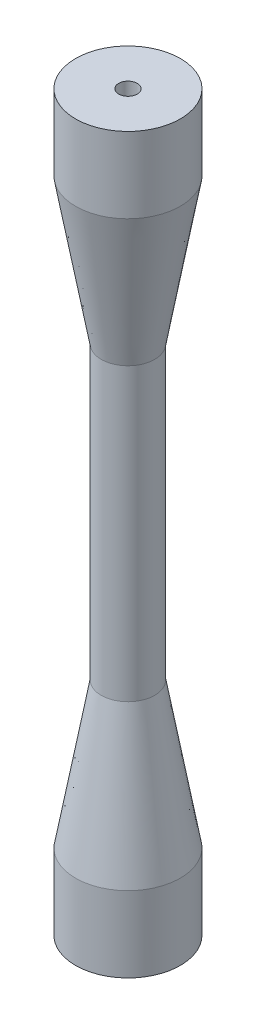
ISO-10303-21;
HEADER;
FILE_DESCRIPTION(('STEP AP214'),'2;1');
FILE_NAME('part.step','',(''),(''),'','','');
FILE_SCHEMA(('AUTOMOTIVE_DESIGN { 1 0 10303 214 1 1 1 1 }'));
ENDSEC;
DATA;
#1=APPLICATION_CONTEXT('core data for automotive mechanical design processes');
#2=APPLICATION_PROTOCOL_DEFINITION('international standard','automotive_design',2000,#1);
#3=PRODUCT_CONTEXT('',#1,'mechanical');
#4=PRODUCT('Part','Part','',(#3));
#5=PRODUCT_RELATED_PRODUCT_CATEGORY('part','',(#4));
#6=PRODUCT_DEFINITION_FORMATION('','',#4);
#7=PRODUCT_DEFINITION_CONTEXT('part definition',#1,'design');
#8=PRODUCT_DEFINITION('design','',#6,#7);
#9=PRODUCT_DEFINITION_SHAPE('','',#8);
#10=(LENGTH_UNIT() NAMED_UNIT(*) SI_UNIT(.MILLI.,.METRE.));
#11=(NAMED_UNIT(*) PLANE_ANGLE_UNIT() SI_UNIT($,.RADIAN.));
#12=(NAMED_UNIT(*) SI_UNIT($,.STERADIAN.) SOLID_ANGLE_UNIT());
#13=UNCERTAINTY_MEASURE_WITH_UNIT(LENGTH_MEASURE(1.E-05),#10,'distance_accuracy_value','');
#14=(GEOMETRIC_REPRESENTATION_CONTEXT(3) GLOBAL_UNCERTAINTY_ASSIGNED_CONTEXT((#13)) GLOBAL_UNIT_ASSIGNED_CONTEXT((#10,
#11,#12)) REPRESENTATION_CONTEXT('',''));
#15=CARTESIAN_POINT('',(0.,0.,0.));
#16=DIRECTION('',(0.,0.,1.));
#17=DIRECTION('',(1.,0.,0.));
#18=AXIS2_PLACEMENT_3D('',#15,#16,#17);
#19=CARTESIAN_POINT('',(0.,3.,0.));
#20=DIRECTION('',(0.,1.,0.));
#21=DIRECTION('',(0.,0.,1.));
#22=AXIS2_PLACEMENT_3D('',#19,#20,#21);
#23=PLANE('',#22);
#24=CARTESIAN_POINT('',(0.,3.,0.));
#25=DIRECTION('',(0.,1.,0.));
#26=DIRECTION('',(0.,0.,1.));
#27=AXIS2_PLACEMENT_3D('',#24,#25,#26);
#28=CIRCLE('',#27,9.);
#29=CARTESIAN_POINT('',(0.,3.,9.));
#30=VERTEX_POINT('',#29);
#31=EDGE_CURVE('E11',#30,#30,#28,.T.);
#32=ORIENTED_EDGE('',*,*,#31,.T.);
#33=EDGE_LOOP('',(#32));
#34=FACE_BOUND('',#33,.T.);
#35=CARTESIAN_POINT('',(0.,3.,0.));
#36=DIRECTION('',(0.,1.,0.));
#37=DIRECTION('',(0.,0.,1.));
#38=AXIS2_PLACEMENT_3D('',#35,#36,#37);
#39=CIRCLE('',#38,1.6);
#40=CARTESIAN_POINT('',(0.,3.,1.6));
#41=VERTEX_POINT('',#40);
#42=EDGE_CURVE('E211',#41,#41,#39,.T.);
#43=ORIENTED_EDGE('',*,*,#42,.F.);
#44=EDGE_LOOP('',(#43));
#45=FACE_BOUND('',#44,.T.);
#46=ADVANCED_FACE('F44',(#34,#45),#23,.T.);
#47=CARTESIAN_POINT('',(0.,0.,0.));
#48=DIRECTION('',(0.,1.,0.));
#49=DIRECTION('',(0.,0.,1.));
#50=AXIS2_PLACEMENT_3D('',#47,#48,#49);
#51=PLANE('',#50);
#52=CARTESIAN_POINT('',(0.,0.,0.));
#53=DIRECTION('',(0.,-1.,0.));
#54=DIRECTION('',(0.,0.,-1.));
#55=AXIS2_PLACEMENT_3D('',#52,#53,#54);
#56=CIRCLE('',#55,5.);
#57=CARTESIAN_POINT('',(0.,0.,-5.));
#58=VERTEX_POINT('',#57);
#59=CARTESIAN_POINT('',(0.,0.,5.));
#60=VERTEX_POINT('',#59);
#61=EDGE_CURVE('E60',#58,#60,#56,.T.);
#62=ORIENTED_EDGE('',*,*,#61,.T.);
#63=DIRECTION('',(-1.,0.,0.));
#64=VECTOR('',#63,1.);
#65=CARTESIAN_POINT('',(0.,0.,5.));
#66=LINE('',#65,#64);
#67=CARTESIAN_POINT('',(-7.48331477354788,0.,5.));
#68=VERTEX_POINT('',#67);
#69=EDGE_CURVE('E179',#60,#68,#66,.T.);
#70=ORIENTED_EDGE('',*,*,#69,.T.);
#71=CARTESIAN_POINT('',(0.,0.,0.));
#72=DIRECTION('',(0.,1.,0.));
#73=DIRECTION('',(0.,0.,1.));
#74=AXIS2_PLACEMENT_3D('',#71,#72,#73);
#75=CIRCLE('',#74,9.);
#76=CARTESIAN_POINT('',(-7.48331477354788,0.,-5.));
#77=VERTEX_POINT('',#76);
#78=EDGE_CURVE('E48',#77,#68,#75,.T.);
#79=ORIENTED_EDGE('',*,*,#78,.F.);
#80=DIRECTION('',(-1.,0.,0.));
#81=VECTOR('',#80,1.);
#82=CARTESIAN_POINT('',(0.,0.,-5.));
#83=LINE('',#82,#81);
#84=EDGE_CURVE('E65',#58,#77,#83,.T.);
#85=ORIENTED_EDGE('',*,*,#84,.F.);
#86=EDGE_LOOP('',(#62,#70,#79,#85));
#87=FACE_BOUND('',#86,.T.);
#88=CARTESIAN_POINT('',(0.,0.,0.));
#89=DIRECTION('',(0.,1.,0.));
#90=DIRECTION('',(0.,0.,1.));
#91=AXIS2_PLACEMENT_3D('',#88,#89,#90);
#92=CIRCLE('',#91,1.6);
#93=CARTESIAN_POINT('',(0.,0.,1.6));
#94=VERTEX_POINT('',#93);
#95=EDGE_CURVE('E210',#94,#94,#92,.T.);
#96=ORIENTED_EDGE('',*,*,#95,.T.);
#97=EDGE_LOOP('',(#96));
#98=FACE_BOUND('',#97,.T.);
#99=ADVANCED_FACE('F219',(#87,#98),#51,.F.);
#100=CARTESIAN_POINT('',(0.,3.,0.));
#101=DIRECTION('',(0.,-1.,0.));
#102=DIRECTION('',(0.,0.,-1.));
#103=AXIS2_PLACEMENT_3D('',#100,#101,#102);
#104=CYLINDRICAL_SURFACE('',#103,9.);
#105=ORIENTED_EDGE('',*,*,#31,.F.);
#106=EDGE_LOOP('',(#105));
#107=FACE_BOUND('',#106,.T.);
#108=ORIENTED_EDGE('',*,*,#78,.T.);
#109=DIRECTION('',(0.,1.,0.));
#110=VECTOR('',#109,1.);
#111=CARTESIAN_POINT('',(-7.48331477354788,-10.,5.));
#112=LINE('',#111,#110);
#113=CARTESIAN_POINT('',(-7.48331477354788,-10.,5.));
#114=VERTEX_POINT('',#113);
#115=EDGE_CURVE('E199',#114,#68,#112,.T.);
#116=ORIENTED_EDGE('',*,*,#115,.F.);
#117=CARTESIAN_POINT('',(0.,-10.,0.));
#118=DIRECTION('',(0.,-1.,0.));
#119=DIRECTION('',(0.,0.,-1.));
#120=AXIS2_PLACEMENT_3D('',#117,#118,#119);
#121=CIRCLE('',#120,9.);
#122=CARTESIAN_POINT('',(-7.48331477354788,-10.,-5.));
#123=VERTEX_POINT('',#122);
#124=EDGE_CURVE('E182',#123,#114,#121,.T.);
#125=ORIENTED_EDGE('',*,*,#124,.F.);
#126=DIRECTION('',(0.,1.,0.));
#127=VECTOR('',#126,1.);
#128=CARTESIAN_POINT('',(-7.48331477354788,-10.,-5.));
#129=LINE('',#128,#127);
#130=EDGE_CURVE('E203',#123,#77,#129,.T.);
#131=ORIENTED_EDGE('',*,*,#130,.T.);
#132=EDGE_LOOP('',(#108,#116,#125,#131));
#133=FACE_BOUND('',#132,.T.);
#134=ADVANCED_FACE('F46',(#107,#133),#104,.T.);
#135=CARTESIAN_POINT('',(0.,3.,0.));
#136=DIRECTION('',(0.,-1.,0.));
#137=DIRECTION('',(0.,0.,-1.));
#138=AXIS2_PLACEMENT_3D('',#135,#136,#137);
#139=CYLINDRICAL_SURFACE('',#138,1.6);
#140=ORIENTED_EDGE('',*,*,#42,.T.);
#141=EDGE_LOOP('',(#140));
#142=FACE_BOUND('',#141,.T.);
#143=ORIENTED_EDGE('',*,*,#95,.F.);
#144=EDGE_LOOP('',(#143));
#145=FACE_BOUND('',#144,.T.);
#146=ADVANCED_FACE('F221',(#142,#145),#139,.F.);
#147=CARTESIAN_POINT('',(0.,-10.,0.));
#148=DIRECTION('',(0.,1.,0.));
#149=DIRECTION('',(0.,0.,1.));
#150=AXIS2_PLACEMENT_3D('',#147,#148,#149);
#151=CYLINDRICAL_SURFACE('',#150,5.);
#152=ORIENTED_EDGE('',*,*,#61,.F.);
#153=DIRECTION('',(0.,1.,0.));
#154=VECTOR('',#153,1.);
#155=CARTESIAN_POINT('',(0.,-10.,-5.));
#156=LINE('',#155,#154);
#157=CARTESIAN_POINT('',(0.,-10.,-5.));
#158=VERTEX_POINT('',#157);
#159=EDGE_CURVE('E207',#158,#58,#156,.T.);
#160=ORIENTED_EDGE('',*,*,#159,.F.);
#161=CARTESIAN_POINT('',(0.,-10.,0.));
#162=DIRECTION('',(0.,-1.,0.));
#163=DIRECTION('',(0.,0.,-1.));
#164=AXIS2_PLACEMENT_3D('',#161,#162,#163);
#165=CIRCLE('',#164,5.);
#166=CARTESIAN_POINT('',(0.,-10.,5.));
#167=VERTEX_POINT('',#166);
#168=EDGE_CURVE('E174',#158,#167,#165,.T.);
#169=ORIENTED_EDGE('',*,*,#168,.T.);
#170=DIRECTION('',(0.,1.,0.));
#171=VECTOR('',#170,1.);
#172=CARTESIAN_POINT('',(0.,-10.,5.));
#173=LINE('',#172,#171);
#174=EDGE_CURVE('E190',#167,#60,#173,.T.);
#175=ORIENTED_EDGE('',*,*,#174,.T.);
#176=EDGE_LOOP('',(#152,#160,#169,#175));
#177=FACE_BOUND('',#176,.T.);
#178=ADVANCED_FACE('F223',(#177),#151,.F.);
#179=CARTESIAN_POINT('',(0.,-10.,-5.));
#180=DIRECTION('',(0.,0.,-1.));
#181=DIRECTION('',(-1.,0.,0.));
#182=AXIS2_PLACEMENT_3D('',#179,#180,#181);
#183=PLANE('',#182);
#184=ORIENTED_EDGE('',*,*,#84,.T.);
#185=ORIENTED_EDGE('',*,*,#130,.F.);
#186=DIRECTION('',(-1.,0.,0.));
#187=VECTOR('',#186,1.);
#188=CARTESIAN_POINT('',(0.,-10.,-5.));
#189=LINE('',#188,#187);
#190=EDGE_CURVE('E178',#158,#123,#189,.T.);
#191=ORIENTED_EDGE('',*,*,#190,.F.);
#192=ORIENTED_EDGE('',*,*,#159,.T.);
#193=EDGE_LOOP('',(#184,#185,#191,#192));
#194=FACE_BOUND('',#193,.T.);
#195=ADVANCED_FACE('F231',(#194),#183,.F.);
#196=CARTESIAN_POINT('',(0.,-10.,5.));
#197=DIRECTION('',(0.,0.,-1.));
#198=DIRECTION('',(-1.,0.,0.));
#199=AXIS2_PLACEMENT_3D('',#196,#197,#198);
#200=PLANE('',#199);
#201=ORIENTED_EDGE('',*,*,#69,.F.);
#202=ORIENTED_EDGE('',*,*,#174,.F.);
#203=DIRECTION('',(-1.,0.,0.));
#204=VECTOR('',#203,1.);
#205=CARTESIAN_POINT('',(0.,-10.,5.));
#206=LINE('',#205,#204);
#207=EDGE_CURVE('E186',#167,#114,#206,.T.);
#208=ORIENTED_EDGE('',*,*,#207,.T.);
#209=ORIENTED_EDGE('',*,*,#115,.T.);
#210=EDGE_LOOP('',(#201,#202,#208,#209));
#211=FACE_BOUND('',#210,.T.);
#212=ADVANCED_FACE('F251',(#211),#200,.T.);
#213=CARTESIAN_POINT('',(0.,-10.,0.));
#214=DIRECTION('',(0.,-1.,0.));
#215=DIRECTION('',(0.,0.,-1.));
#216=AXIS2_PLACEMENT_3D('',#213,#214,#215);
#217=PLANE('',#216);
#218=ORIENTED_EDGE('',*,*,#168,.F.);
#219=ORIENTED_EDGE('',*,*,#190,.T.);
#220=CARTESIAN_POINT('',(0.,-10.,0.));
#221=DIRECTION('',(0.,-1.,0.));
#222=DIRECTION('',(0.,0.,-1.));
#223=AXIS2_PLACEMENT_3D('',#220,#221,#222);
#224=CIRCLE('',#223,9.);
#225=EDGE_CURVE('E164',#114,#123,#224,.T.);
#226=ORIENTED_EDGE('',*,*,#225,.F.);
#227=ORIENTED_EDGE('',*,*,#207,.F.);
#228=EDGE_LOOP('',(#218,#219,#226,#227));
#229=FACE_BOUND('',#228,.T.);
#230=ADVANCED_FACE('F254',(#229),#217,.F.);
#231=CARTESIAN_POINT('',(0.,-10.,0.));
#232=DIRECTION('',(0.,1.,0.));
#233=DIRECTION('',(0.,0.,-1.));
#234=AXIS2_PLACEMENT_3D('',#231,#232,#233);
#235=CONICAL_SURFACE('',#234,9.,0.174532925199433);
#236=CARTESIAN_POINT('',(0.,-35.,0.));
#237=DIRECTION('',(0.,-1.,0.));
#238=DIRECTION('',(0.,0.,-1.));
#239=AXIS2_PLACEMENT_3D('',#236,#237,#238);
#240=CIRCLE('',#239,4.59182548228838);
#241=CARTESIAN_POINT('',(0.,-35.,-4.59182548228838));
#242=VERTEX_POINT('',#241);
#243=EDGE_CURVE('E170',#242,#242,#240,.T.);
#244=ORIENTED_EDGE('',*,*,#243,.F.);
#245=EDGE_LOOP('',(#244));
#246=FACE_BOUND('',#245,.T.);
#247=ORIENTED_EDGE('',*,*,#225,.T.);
#248=ORIENTED_EDGE('',*,*,#124,.T.);
#249=EDGE_LOOP('',(#247,#248));
#250=FACE_BOUND('',#249,.T.);
#251=ADVANCED_FACE('F258',(#246,#250),#235,.T.);
#252=CARTESIAN_POINT('',(0.,-60.,0.));
#253=DIRECTION('',(0.,1.,0.));
#254=DIRECTION('',(0.,0.,1.));
#255=AXIS2_PLACEMENT_3D('',#252,#253,#254);
#256=CYLINDRICAL_SURFACE('',#255,4.59182548228838);
#257=ORIENTED_EDGE('',*,*,#243,.T.);
#258=EDGE_LOOP('',(#257));
#259=FACE_BOUND('',#258,.T.);
#260=CARTESIAN_POINT('',(0.,-85.,0.));
#261=DIRECTION('',(0.,-1.,0.));
#262=DIRECTION('',(0.,0.,-1.));
#263=AXIS2_PLACEMENT_3D('',#260,#261,#262);
#264=CIRCLE('',#263,4.59182548228838);
#265=CARTESIAN_POINT('',(0.,-85.,-4.59182548228838));
#266=VERTEX_POINT('',#265);
#267=EDGE_CURVE('E119',#266,#266,#264,.T.);
#268=ORIENTED_EDGE('',*,*,#267,.F.);
#269=EDGE_LOOP('',(#268));
#270=FACE_BOUND('',#269,.T.);
#271=ADVANCED_FACE('F260',(#259,#270),#256,.T.);
#272=CARTESIAN_POINT('',(0.,-123.,0.));
#273=DIRECTION('',(0.,-1.,0.));
#274=DIRECTION('',(0.,0.,1.));
#275=AXIS2_PLACEMENT_3D('',#272,#273,#274);
#276=PLANE('',#275);
#277=CARTESIAN_POINT('',(0.,-123.,0.));
#278=DIRECTION('',(0.,1.,0.));
#279=DIRECTION('',(0.,0.,1.));
#280=AXIS2_PLACEMENT_3D('',#277,#278,#279);
#281=CIRCLE('',#280,9.);
#282=CARTESIAN_POINT('',(0.,-123.,9.));
#283=VERTEX_POINT('',#282);
#284=EDGE_CURVE('E160',#283,#283,#281,.T.);
#285=ORIENTED_EDGE('',*,*,#284,.F.);
#286=EDGE_LOOP('',(#285));
#287=FACE_BOUND('',#286,.T.);
#288=CARTESIAN_POINT('',(0.,-123.,0.));
#289=DIRECTION('',(0.,1.,0.));
#290=DIRECTION('',(0.,0.,1.));
#291=AXIS2_PLACEMENT_3D('',#288,#289,#290);
#292=CIRCLE('',#291,1.6);
#293=CARTESIAN_POINT('',(0.,-123.,1.6));
#294=VERTEX_POINT('',#293);
#295=EDGE_CURVE('E153',#294,#294,#292,.T.);
#296=ORIENTED_EDGE('',*,*,#295,.T.);
#297=EDGE_LOOP('',(#296));
#298=FACE_BOUND('',#297,.T.);
#299=ADVANCED_FACE('F267',(#287,#298),#276,.T.);
#300=CARTESIAN_POINT('',(0.,-120.,0.));
#301=DIRECTION('',(0.,-1.,0.));
#302=DIRECTION('',(0.,0.,1.));
#303=AXIS2_PLACEMENT_3D('',#300,#301,#302);
#304=PLANE('',#303);
#305=CARTESIAN_POINT('',(0.,-120.,0.));
#306=DIRECTION('',(0.,-1.,0.));
#307=DIRECTION('',(0.,0.,-1.));
#308=AXIS2_PLACEMENT_3D('',#305,#306,#307);
#309=CIRCLE('',#308,5.);
#310=CARTESIAN_POINT('',(0.,-120.,-5.));
#311=VERTEX_POINT('',#310);
#312=CARTESIAN_POINT('',(0.,-120.,5.));
#313=VERTEX_POINT('',#312);
#314=EDGE_CURVE('E398',#311,#313,#309,.T.);
#315=ORIENTED_EDGE('',*,*,#314,.F.);
#316=DIRECTION('',(-1.,0.,0.));
#317=VECTOR('',#316,1.);
#318=CARTESIAN_POINT('',(0.,-120.,-5.));
#319=LINE('',#318,#317);
#320=CARTESIAN_POINT('',(-7.48331477354788,-120.,-5.));
#321=VERTEX_POINT('',#320);
#322=EDGE_CURVE('E402',#311,#321,#319,.T.);
#323=ORIENTED_EDGE('',*,*,#322,.T.);
#324=CARTESIAN_POINT('',(0.,-120.,0.));
#325=DIRECTION('',(0.,1.,0.));
#326=DIRECTION('',(0.,0.,1.));
#327=AXIS2_PLACEMENT_3D('',#324,#325,#326);
#328=CIRCLE('',#327,9.);
#329=CARTESIAN_POINT('',(-7.48331477354788,-120.,5.));
#330=VERTEX_POINT('',#329);
#331=EDGE_CURVE('E140',#321,#330,#328,.T.);
#332=ORIENTED_EDGE('',*,*,#331,.T.);
#333=DIRECTION('',(-1.,0.,0.));
#334=VECTOR('',#333,1.);
#335=CARTESIAN_POINT('',(0.,-120.,5.));
#336=LINE('',#335,#334);
#337=EDGE_CURVE('E406',#313,#330,#336,.T.);
#338=ORIENTED_EDGE('',*,*,#337,.F.);
#339=EDGE_LOOP('',(#315,#323,#332,#338));
#340=FACE_BOUND('',#339,.T.);
#341=CARTESIAN_POINT('',(0.,-120.,0.));
#342=DIRECTION('',(0.,1.,0.));
#343=DIRECTION('',(0.,0.,1.));
#344=AXIS2_PLACEMENT_3D('',#341,#342,#343);
#345=CIRCLE('',#344,1.6);
#346=CARTESIAN_POINT('',(0.,-120.,1.6));
#347=VERTEX_POINT('',#346);
#348=EDGE_CURVE('E147',#347,#347,#345,.T.);
#349=ORIENTED_EDGE('',*,*,#348,.F.);
#350=EDGE_LOOP('',(#349));
#351=FACE_BOUND('',#350,.T.);
#352=ADVANCED_FACE('F311',(#340,#351),#304,.F.);
#353=CARTESIAN_POINT('',(0.,-123.,0.));
#354=DIRECTION('',(0.,1.,0.));
#355=DIRECTION('',(0.,0.,-1.));
#356=AXIS2_PLACEMENT_3D('',#353,#354,#355);
#357=CYLINDRICAL_SURFACE('',#356,9.);
#358=ORIENTED_EDGE('',*,*,#284,.T.);
#359=EDGE_LOOP('',(#358));
#360=FACE_BOUND('',#359,.T.);
#361=ORIENTED_EDGE('',*,*,#331,.F.);
#362=DIRECTION('',(0.,-1.,0.));
#363=VECTOR('',#362,1.);
#364=CARTESIAN_POINT('',(-7.48331477354788,-110.,-5.));
#365=LINE('',#364,#363);
#366=CARTESIAN_POINT('',(-7.48331477354788,-110.,-5.));
#367=VERTEX_POINT('',#366);
#368=EDGE_CURVE('E125',#367,#321,#365,.T.);
#369=ORIENTED_EDGE('',*,*,#368,.F.);
#370=CARTESIAN_POINT('',(0.,-110.,0.));
#371=DIRECTION('',(0.,-1.,0.));
#372=DIRECTION('',(0.,0.,-1.));
#373=AXIS2_PLACEMENT_3D('',#370,#371,#372);
#374=CIRCLE('',#373,9.);
#375=CARTESIAN_POINT('',(-7.48331477354788,-110.,5.));
#376=VERTEX_POINT('',#375);
#377=EDGE_CURVE('E130',#367,#376,#374,.T.);
#378=ORIENTED_EDGE('',*,*,#377,.T.);
#379=DIRECTION('',(0.,-1.,0.));
#380=VECTOR('',#379,1.);
#381=CARTESIAN_POINT('',(-7.48331477354788,-110.,5.));
#382=LINE('',#381,#380);
#383=EDGE_CURVE('E143',#376,#330,#382,.T.);
#384=ORIENTED_EDGE('',*,*,#383,.T.);
#385=EDGE_LOOP('',(#361,#369,#378,#384));
#386=FACE_BOUND('',#385,.T.);
#387=ADVANCED_FACE('F138',(#360,#386),#357,.T.);
#388=CARTESIAN_POINT('',(0.,-123.,0.));
#389=DIRECTION('',(0.,1.,0.));
#390=DIRECTION('',(0.,0.,-1.));
#391=AXIS2_PLACEMENT_3D('',#388,#389,#390);
#392=CYLINDRICAL_SURFACE('',#391,1.6);
#393=ORIENTED_EDGE('',*,*,#295,.F.);
#394=EDGE_LOOP('',(#393));
#395=FACE_BOUND('',#394,.T.);
#396=ORIENTED_EDGE('',*,*,#348,.T.);
#397=EDGE_LOOP('',(#396));
#398=FACE_BOUND('',#397,.T.);
#399=ADVANCED_FACE('F330',(#395,#398),#392,.F.);
#400=CARTESIAN_POINT('',(0.,-110.,0.));
#401=DIRECTION('',(0.,-1.,0.));
#402=DIRECTION('',(0.,0.,1.));
#403=AXIS2_PLACEMENT_3D('',#400,#401,#402);
#404=CYLINDRICAL_SURFACE('',#403,5.);
#405=ORIENTED_EDGE('',*,*,#314,.T.);
#406=DIRECTION('',(0.,-1.,0.));
#407=VECTOR('',#406,1.);
#408=CARTESIAN_POINT('',(0.,-110.,5.));
#409=LINE('',#408,#407);
#410=CARTESIAN_POINT('',(0.,-110.,5.));
#411=VERTEX_POINT('',#410);
#412=EDGE_CURVE('E149',#411,#313,#409,.T.);
#413=ORIENTED_EDGE('',*,*,#412,.F.);
#414=CARTESIAN_POINT('',(0.,-110.,0.));
#415=DIRECTION('',(0.,-1.,0.));
#416=DIRECTION('',(0.,0.,-1.));
#417=AXIS2_PLACEMENT_3D('',#414,#415,#416);
#418=CIRCLE('',#417,5.);
#419=CARTESIAN_POINT('',(0.,-110.,-5.));
#420=VERTEX_POINT('',#419);
#421=EDGE_CURVE('E131',#420,#411,#418,.T.);
#422=ORIENTED_EDGE('',*,*,#421,.F.);
#423=DIRECTION('',(0.,-1.,0.));
#424=VECTOR('',#423,1.);
#425=CARTESIAN_POINT('',(0.,-110.,-5.));
#426=LINE('',#425,#424);
#427=EDGE_CURVE('E127',#420,#311,#426,.T.);
#428=ORIENTED_EDGE('',*,*,#427,.T.);
#429=EDGE_LOOP('',(#405,#413,#422,#428));
#430=FACE_BOUND('',#429,.T.);
#431=ADVANCED_FACE('F346',(#430),#404,.F.);
#432=CARTESIAN_POINT('',(0.,-110.,-5.));
#433=DIRECTION('',(0.,0.,-1.));
#434=DIRECTION('',(-1.,0.,0.));
#435=AXIS2_PLACEMENT_3D('',#432,#433,#434);
#436=PLANE('',#435);
#437=ORIENTED_EDGE('',*,*,#322,.F.);
#438=ORIENTED_EDGE('',*,*,#427,.F.);
#439=DIRECTION('',(-1.,0.,0.));
#440=VECTOR('',#439,1.);
#441=CARTESIAN_POINT('',(0.,-110.,-5.));
#442=LINE('',#441,#440);
#443=EDGE_CURVE('E112',#420,#367,#442,.T.);
#444=ORIENTED_EDGE('',*,*,#443,.T.);
#445=ORIENTED_EDGE('',*,*,#368,.T.);
#446=EDGE_LOOP('',(#437,#438,#444,#445));
#447=FACE_BOUND('',#446,.T.);
#448=ADVANCED_FACE('F123',(#447),#436,.F.);
#449=CARTESIAN_POINT('',(0.,-110.,5.));
#450=DIRECTION('',(0.,0.,-1.));
#451=DIRECTION('',(-1.,0.,0.));
#452=AXIS2_PLACEMENT_3D('',#449,#450,#451);
#453=PLANE('',#452);
#454=ORIENTED_EDGE('',*,*,#337,.T.);
#455=ORIENTED_EDGE('',*,*,#383,.F.);
#456=DIRECTION('',(-1.,0.,0.));
#457=VECTOR('',#456,1.);
#458=CARTESIAN_POINT('',(0.,-110.,5.));
#459=LINE('',#458,#457);
#460=EDGE_CURVE('E114',#411,#376,#459,.T.);
#461=ORIENTED_EDGE('',*,*,#460,.F.);
#462=ORIENTED_EDGE('',*,*,#412,.T.);
#463=EDGE_LOOP('',(#454,#455,#461,#462));
#464=FACE_BOUND('',#463,.T.);
#465=ADVANCED_FACE('F365',(#464),#453,.T.);
#466=CARTESIAN_POINT('',(0.,-110.,0.));
#467=DIRECTION('',(0.,1.,0.));
#468=DIRECTION('',(0.,0.,-1.));
#469=AXIS2_PLACEMENT_3D('',#466,#467,#468);
#470=PLANE('',#469);
#471=ORIENTED_EDGE('',*,*,#421,.T.);
#472=ORIENTED_EDGE('',*,*,#460,.T.);
#473=CARTESIAN_POINT('',(0.,-110.,0.));
#474=DIRECTION('',(0.,-1.,0.));
#475=DIRECTION('',(0.,0.,-1.));
#476=AXIS2_PLACEMENT_3D('',#473,#474,#475);
#477=CIRCLE('',#476,9.);
#478=EDGE_CURVE('E108',#376,#367,#477,.T.);
#479=ORIENTED_EDGE('',*,*,#478,.T.);
#480=ORIENTED_EDGE('',*,*,#443,.F.);
#481=EDGE_LOOP('',(#471,#472,#479,#480));
#482=FACE_BOUND('',#481,.T.);
#483=ADVANCED_FACE('F111',(#482),#470,.F.);
#484=CARTESIAN_POINT('',(0.,-110.,0.));
#485=DIRECTION('',(0.,-1.,0.));
#486=DIRECTION('',(0.,0.,-1.));
#487=AXIS2_PLACEMENT_3D('',#484,#485,#486);
#488=CONICAL_SURFACE('',#487,9.,0.174532925199433);
#489=ORIENTED_EDGE('',*,*,#267,.T.);
#490=EDGE_LOOP('',(#489));
#491=FACE_BOUND('',#490,.T.);
#492=ORIENTED_EDGE('',*,*,#478,.F.);
#493=ORIENTED_EDGE('',*,*,#377,.F.);
#494=EDGE_LOOP('',(#492,#493));
#495=FACE_BOUND('',#494,.T.);
#496=ADVANCED_FACE('F134',(#491,#495),#488,.T.);
#497=CLOSED_SHELL('',(#46,#99,#134,#146,#178,#195,#212,#230,#251,#271,#299,#352,#387,#399,#431,
#448,#465,#483,#496));
#498=MANIFOLD_SOLID_BREP('B2',#497);
#499=ADVANCED_BREP_SHAPE_REPRESENTATION('',(#18,#498),#14);
#500=SHAPE_DEFINITION_REPRESENTATION(#9,#499);
ENDSEC;
END-ISO-10303-21;
